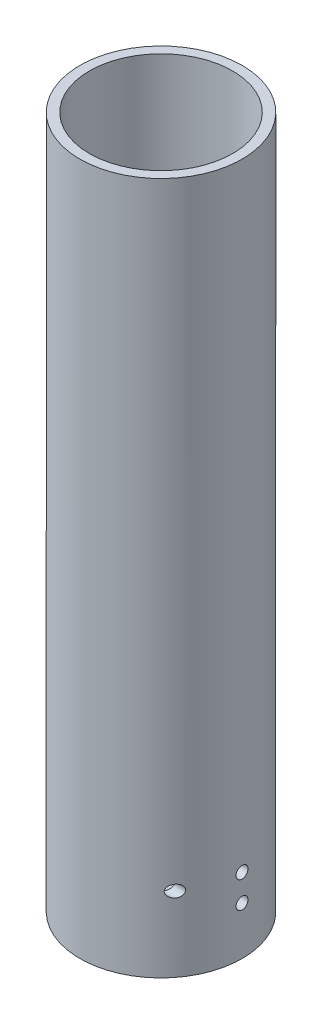
ISO-10303-21;
HEADER;
FILE_DESCRIPTION(('STEP AP214'),'2;1');
FILE_NAME('part.step','',(''),(''),'','','');
FILE_SCHEMA(('AUTOMOTIVE_DESIGN { 1 0 10303 214 1 1 1 1 }'));
ENDSEC;
DATA;
#1=APPLICATION_CONTEXT('core data for automotive mechanical design processes');
#2=APPLICATION_PROTOCOL_DEFINITION('international standard','automotive_design',2000,#1);
#3=PRODUCT_CONTEXT('',#1,'mechanical');
#4=PRODUCT('Part','Part','',(#3));
#5=PRODUCT_RELATED_PRODUCT_CATEGORY('part','',(#4));
#6=PRODUCT_DEFINITION_FORMATION('','',#4);
#7=PRODUCT_DEFINITION_CONTEXT('part definition',#1,'design');
#8=PRODUCT_DEFINITION('design','',#6,#7);
#9=PRODUCT_DEFINITION_SHAPE('','',#8);
#10=(LENGTH_UNIT() NAMED_UNIT(*) SI_UNIT(.MILLI.,.METRE.));
#11=(NAMED_UNIT(*) PLANE_ANGLE_UNIT() SI_UNIT($,.RADIAN.));
#12=(NAMED_UNIT(*) SI_UNIT($,.STERADIAN.) SOLID_ANGLE_UNIT());
#13=UNCERTAINTY_MEASURE_WITH_UNIT(LENGTH_MEASURE(1.E-05),#10,'distance_accuracy_value','');
#14=(GEOMETRIC_REPRESENTATION_CONTEXT(3) GLOBAL_UNCERTAINTY_ASSIGNED_CONTEXT((#13)) GLOBAL_UNIT_ASSIGNED_CONTEXT((#10,
#11,#12)) REPRESENTATION_CONTEXT('',''));
#15=CARTESIAN_POINT('',(0.,0.,0.));
#16=DIRECTION('',(0.,0.,1.));
#17=DIRECTION('',(1.,0.,0.));
#18=AXIS2_PLACEMENT_3D('',#15,#16,#17);
#19=CARTESIAN_POINT('',(0.,140.,0.));
#20=DIRECTION('',(0.,-1.,0.));
#21=DIRECTION('',(0.,0.,-1.));
#22=AXIS2_PLACEMENT_3D('',#19,#20,#21);
#23=CYLINDRICAL_SURFACE('',#22,17.);
#24=CARTESIAN_POINT('',(0.,140.,0.));
#25=DIRECTION('',(0.,1.,0.));
#26=DIRECTION('',(0.,0.,1.));
#27=AXIS2_PLACEMENT_3D('',#24,#25,#26);
#28=CIRCLE('',#27,17.);
#29=CARTESIAN_POINT('',(0.,140.,17.));
#30=VERTEX_POINT('',#29);
#31=EDGE_CURVE('E10',#30,#30,#28,.T.);
#32=ORIENTED_EDGE('',*,*,#31,.F.);
#33=EDGE_LOOP('',(#32));
#34=FACE_BOUND('',#33,.T.);
#35=CARTESIAN_POINT('',(0.,-5.,0.));
#36=DIRECTION('',(0.,-1.,0.));
#37=DIRECTION('',(0.,0.,-1.));
#38=AXIS2_PLACEMENT_3D('',#35,#36,#37);
#39=CIRCLE('',#38,17.);
#40=CARTESIAN_POINT('',(0.,-5.,-17.));
#41=VERTEX_POINT('',#40);
#42=EDGE_CURVE('E97',#41,#41,#39,.T.);
#43=ORIENTED_EDGE('',*,*,#42,.F.);
#44=EDGE_LOOP('',(#43));
#45=FACE_BOUND('',#44,.T.);
#46=CARTESIAN_POINT('',(12.3526034397278,10.6689063433887,11.6796056551934));
#47=CARTESIAN_POINT('',(12.3526050452797,10.6117830538209,11.6796041188875));
#48=CARTESIAN_POINT('',(12.3563381656127,10.5546494273182,11.6756595388602));
#49=CARTESIAN_POINT('',(12.3709163959416,10.4423464650453,11.6602116034412));
#50=CARTESIAN_POINT('',(12.3817664896325,10.3871785343255,11.6487029512601));
#51=CARTESIAN_POINT('',(12.4095658564647,10.2807307183021,11.6190825172819));
#52=CARTESIAN_POINT('',(12.4264744421042,10.2294275951184,11.601014774483));
#53=CARTESIAN_POINT('',(12.465282080562,10.1311976198045,11.55930597497));
#54=CARTESIAN_POINT('',(12.4871836560253,10.0842729968039,11.5356621007767));
#55=CARTESIAN_POINT('',(12.5444865641857,9.977339675201,11.4733725439603));
#56=CARTESIAN_POINT('',(12.5817788909717,9.91963349038183,11.4325136923492));
#57=CARTESIAN_POINT('',(12.6616274113348,9.81384785534665,11.3440189308618));
#58=CARTESIAN_POINT('',(12.7041945573332,9.76578899705376,11.2963688881783));
#59=CARTESIAN_POINT('',(12.8060000682101,9.66622114269812,11.1809608854319));
#60=CARTESIAN_POINT('',(12.8664229938381,9.61796145656463,11.1114454551571));
#61=CARTESIAN_POINT('',(12.9902674969686,9.53698283225218,10.9664067253002));
#62=CARTESIAN_POINT('',(13.0536905646312,9.50427170802753,10.8908804271574));
#63=CARTESIAN_POINT('',(13.1824030075432,9.45391489864469,10.7347385362961));
#64=CARTESIAN_POINT('',(13.2477058949806,9.43646838874405,10.6540699810188));
#65=CARTESIAN_POINT('',(13.3777274715619,9.41766583869734,10.4903453112267));
#66=CARTESIAN_POINT('',(13.4424458406072,9.4163181371467,10.4072879817373));
#67=CARTESIAN_POINT('',(13.5748986164153,9.43100047446755,10.2340096788228));
#68=CARTESIAN_POINT('',(13.6424462631271,9.44846201944534,10.1437588372146));
#69=CARTESIAN_POINT('',(13.7726581137172,9.50425512520184,9.96623997458606));
#70=CARTESIAN_POINT('',(13.8353310333005,9.5425484118271,9.87896679426158));
#71=CARTESIAN_POINT('',(13.9353744807645,9.6260804427821,9.73706790802242));
#72=CARTESIAN_POINT('',(13.9746842417562,9.66576267774237,9.68052004075442));
#73=CARTESIAN_POINT('',(14.0485283647382,9.75583435735589,9.57303950626107));
#74=CARTESIAN_POINT('',(14.0830649918721,9.8062186942088,9.52210417788587));
#75=CARTESIAN_POINT('',(14.1463735225243,9.91773529336315,9.42779823807859));
#76=CARTESIAN_POINT('',(14.1750935773978,9.97895582249573,9.38449607565597));
#77=CARTESIAN_POINT('',(14.2249892794054,10.1105199968638,9.30869235676485));
#78=CARTESIAN_POINT('',(14.2461727904248,10.1808540275688,9.27617954471942));
#79=CARTESIAN_POINT('',(14.2772911060382,10.3173808105524,9.22819901990391));
#80=CARTESIAN_POINT('',(14.2884191794244,10.3826708017922,9.21093202934248));
#81=CARTESIAN_POINT('',(14.3037176772698,10.5159595066296,9.18715781761185));
#82=CARTESIAN_POINT('',(14.3078938542426,10.5839559329644,9.18064170041427));
#83=CARTESIAN_POINT('',(14.3090103901253,10.7124913017673,9.17890059063317));
#84=CARTESIAN_POINT('',(14.3067091663162,10.7730120517699,9.1824921191528));
#85=CARTESIAN_POINT('',(14.2965633163339,10.8924312496822,9.19828053330078));
#86=CARTESIAN_POINT('',(14.2887196312111,10.9513299712314,9.21047595807932));
#87=CARTESIAN_POINT('',(14.2679307093816,11.0652580144872,9.24264631125735));
#88=CARTESIAN_POINT('',(14.2550435935976,11.1203232850391,9.26253257998185));
#89=CARTESIAN_POINT('',(14.2246374018501,11.2260818315445,9.30916013774091));
#90=CARTESIAN_POINT('',(14.2071172838214,11.2767741205111,9.33590296892746));
#91=CARTESIAN_POINT('',(14.16649473502,11.3766006342079,9.39744023632236));
#92=CARTESIAN_POINT('',(14.1430672900247,11.4253173969015,9.43269479603172));
#93=CARTESIAN_POINT('',(14.0921977181718,11.5160254000268,9.50852506749673));
#94=CARTESIAN_POINT('',(14.0647538225743,11.5580136602473,9.54910312276092));
#95=CARTESIAN_POINT('',(14.0024346404783,11.6403869005993,9.64029452594988));
#96=CARTESIAN_POINT('',(13.967057038321,11.6797156229166,9.69151659249575));
#97=CARTESIAN_POINT('',(13.892880471928,11.7492008583913,9.79755424055716));
#98=CARTESIAN_POINT('',(13.8540795126972,11.7793519770587,9.85237191260971));
#99=CARTESIAN_POINT('',(13.7666964120705,11.8352505244753,9.9741982091821));
#100=CARTESIAN_POINT('',(13.7176032006081,11.8592564979711,10.0416388710078));
#101=CARTESIAN_POINT('',(13.6168918768727,11.8953062401406,10.1777918548919));
#102=CARTESIAN_POINT('',(13.5652724616793,11.907343766244,10.2465048215545));
#103=CARTESIAN_POINT('',(13.4512272641178,11.9210799511428,10.3959021973789));
#104=CARTESIAN_POINT('',(13.3885003414573,11.9205825030337,10.4765621138471));
#105=CARTESIAN_POINT('',(13.2623064471626,11.9043736755705,10.635863080248));
#106=CARTESIAN_POINT('',(13.1988386339086,11.8886428985329,10.7145014248963));
#107=CARTESIAN_POINT('',(13.0658141582953,11.8397075592706,10.8764255831265));
#108=CARTESIAN_POINT('',(12.9963530639763,11.8047758984454,10.9592753055889));
#109=CARTESIAN_POINT('',(12.8610457841965,11.7163681426347,11.1177472503364));
#110=CARTESIAN_POINT('',(12.7951945973602,11.6629184962775,11.1933795855259));
#111=CARTESIAN_POINT('',(12.6910379744468,11.5574308651206,11.3111275753113));
#112=CARTESIAN_POINT('',(12.6507371953663,11.5105829728803,11.3561459533478));
#113=CARTESIAN_POINT('',(12.5751068991561,11.4080269210315,11.43983592475));
#114=CARTESIAN_POINT('',(12.5397692842329,11.3523335175936,11.4785178740638));
#115=CARTESIAN_POINT('',(12.4828575649107,11.2448822479486,11.5403490689118));
#116=CARTESIAN_POINT('',(12.4599503431925,11.1947321696676,11.5650550626099));
#117=CARTESIAN_POINT('',(12.4199024917456,11.0895916257044,11.6080526900088));
#118=CARTESIAN_POINT('',(12.4027554148344,11.0346066591865,11.6263514960885));
#119=CARTESIAN_POINT('',(12.3772685541967,10.9282406032907,11.6534770570378));
#120=CARTESIAN_POINT('',(12.3680832159493,10.8772971004468,11.6632155150884));
#121=CARTESIAN_POINT('',(12.3557509905346,10.7738737214084,11.676279384188));
#122=CARTESIAN_POINT('',(12.3526019644574,10.7213943961127,11.6796070668367));
#123=CARTESIAN_POINT('',(12.3526034397278,10.6689063433887,11.6796056551934));
#124=B_SPLINE_CURVE_WITH_KNOTS('',3,(#46,#47,#48,#49,#50,#51,#52,#53,#54,#55,#56,#57,#58,#59,
#60,#61,#62,#63,#64,#65,#66,#67,#68,#69,#70,#71,#72,#73,#74,#75,#76,#77,#78,#79,#80,#81,#82,#83,
#84,#85,#86,#87,#88,#89,#90,#91,#92,#93,#94,#95,#96,#97,#98,#99,#100,#101,#102,#103,#104,#105,
#106,#107,#108,#109,#110,#111,#112,#113,#114,#115,#116,#117,#118,#119,#120,#121,#122,#123),
.UNSPECIFIED.,.T.,.F.,(4,2,2,2,2,2,2,2,2,2,2,2,2,2,2,2,2,2,2,2,2,2,2,2,2,2,2,2,2,2,2,2,2,2,2,2,
2,2,4),(0.,0.171142961782552,0.342405895373957,0.512539583151093,0.682759420084538,
0.921263071554698,1.16027051181133,1.47059348352221,1.78107224407733,2.09554422912971,
2.41017909213956,2.75056877158188,3.09033515502291,3.3278713176067,3.56529436483965,
3.80474870695547,4.04395245639738,4.24811384759981,4.45210621643239,4.63323875953179,
4.81434055565655,4.99341402425062,5.17252780475569,5.36537464827501,5.55830667347788,
5.77837641402882,5.99857526035828,6.25800280886825,6.5175656001868,6.82287539146012,
7.12857446736418,7.46779848491141,7.80653998383667,8.03515733190166,8.26339722838393,
8.44396364849718,8.62432728655689,8.78163870216074,8.93889436564471),.UNSPECIFIED.);
#125=CARTESIAN_POINT('',(12.3526034397278,10.6689063433887,11.6796056551934));
#126=VERTEX_POINT('',#125);
#127=EDGE_CURVE('E61',#126,#126,#124,.T.);
#128=ORIENTED_EDGE('',*,*,#127,.F.);
#129=EDGE_LOOP('',(#128));
#130=FACE_BOUND('',#129,.T.);
#131=CARTESIAN_POINT('',(17.,9.41890634338872,0.));
#132=CARTESIAN_POINT('',(16.9999993933768,9.4189094175482,-0.0701114374009968));
#133=CARTESIAN_POINT('',(16.9995616381418,9.42482491136245,-0.140271293942132));
#134=CARTESIAN_POINT('',(16.9978574325815,9.44833699755417,-0.278651803569587));
#135=CARTESIAN_POINT('',(16.9965900304269,9.46594700703697,-0.346870135286048));
#136=CARTESIAN_POINT('',(16.9933698319174,9.51233787804617,-0.479343249225228));
#137=CARTESIAN_POINT('',(16.9914174101675,9.54111263500522,-0.543600175220227));
#138=CARTESIAN_POINT('',(16.9870464492067,9.60900577583922,-0.66635592104581));
#139=CARTESIAN_POINT('',(16.9846280132903,9.64812186821577,-0.724856012576288));
#140=CARTESIAN_POINT('',(16.9795911820933,9.73567302488676,-0.834571599289302));
#141=CARTESIAN_POINT('',(16.9769724376049,9.78412459824349,-0.885773905619761));
#142=CARTESIAN_POINT('',(16.971833091802,9.88893679559828,-0.979327467680684));
#143=CARTESIAN_POINT('',(16.9693124946942,9.94529775812924,-1.02167834436435));
#144=CARTESIAN_POINT('',(16.9646508997728,10.0644066314624,-1.09636989797495));
#145=CARTESIAN_POINT('',(16.9625103329139,10.1271616678719,-1.12869924106479));
#146=CARTESIAN_POINT('',(16.9588548577996,10.2572275054898,-1.18235757434903));
#147=CARTESIAN_POINT('',(16.9573399406884,10.3245382421986,-1.20368672024734));
#148=CARTESIAN_POINT('',(16.9551100202027,10.4616746122315,-1.23470160843389));
#149=CARTESIAN_POINT('',(16.954393562983,10.5314954349897,-1.2444085150376));
#150=CARTESIAN_POINT('',(16.9538370102126,10.6717787952404,-1.25196874085017));
#151=CARTESIAN_POINT('',(16.9539969015194,10.7422413230935,-1.24982223782256));
#152=CARTESIAN_POINT('',(16.9551736661373,10.8816633041332,-1.23375409879929));
#153=CARTESIAN_POINT('',(16.9561888691461,10.9506254183468,-1.2198554129539));
#154=CARTESIAN_POINT('',(16.9589592357487,11.0852352394591,-1.18071306766581));
#155=CARTESIAN_POINT('',(16.9607144051605,11.1508829202929,-1.15546931902006));
#156=CARTESIAN_POINT('',(16.9647688493341,11.2770738230436,-1.09432754752814));
#157=CARTESIAN_POINT('',(16.9670686524487,11.3376120103653,-1.05841917020422));
#158=CARTESIAN_POINT('',(16.9719527073521,11.4518104230797,-0.976974930058658));
#159=CARTESIAN_POINT('',(16.9745369636057,11.505470540487,-0.931438916113306));
#160=CARTESIAN_POINT('',(16.9797061473361,11.6045230847041,-0.831903010117666));
#161=CARTESIAN_POINT('',(16.9822910618214,11.6498955664564,-0.777883266806281));
#162=CARTESIAN_POINT('',(16.9871644111301,11.7309308565704,-0.662982748302863));
#163=CARTESIAN_POINT('',(16.989452845808,11.7665936601699,-0.602101969745843));
#164=CARTESIAN_POINT('',(16.9934756796063,11.8271957915862,-0.475195034746847));
#165=CARTESIAN_POINT('',(16.995210036429,11.8521343007772,-0.409168485963105));
#166=CARTESIAN_POINT('',(16.997928768922,11.8905662917393,-0.273849933141372));
#167=CARTESIAN_POINT('',(16.9989131567097,11.9040599584291,-0.204557981882798));
#168=CARTESIAN_POINT('',(17.0000194759722,11.9191943705138,-0.0648485325756396));
#169=CARTESIAN_POINT('',(17.0001434129875,11.9208626786702,0.00556596447100608));
#170=CARTESIAN_POINT('',(16.999520211201,11.9123711264656,0.145673719645361));
#171=CARTESIAN_POINT('',(16.9987730787023,11.9022113516928,0.215366982988247));
#172=CARTESIAN_POINT('',(16.9964930937958,11.8703748656696,0.351975823839941));
#173=CARTESIAN_POINT('',(16.9949611085735,11.8487108645001,0.418894379105056));
#174=CARTESIAN_POINT('',(16.9912836430185,11.7944938310118,0.548146305699546));
#175=CARTESIAN_POINT('',(16.9891381550843,11.7619406637703,0.610479620203657));
#176=CARTESIAN_POINT('',(16.9844694753328,11.6867996415993,0.728917485090241));
#177=CARTESIAN_POINT('',(16.9819455964897,11.6441934514357,0.785010375482227));
#178=CARTESIAN_POINT('',(16.9768062475212,11.5501824041896,0.889257583979707));
#179=CARTESIAN_POINT('',(16.9741907761557,11.498777427939,0.937411794548647));
#180=CARTESIAN_POINT('',(16.969157145074,11.388508746897,1.02450867468885));
#181=CARTESIAN_POINT('',(16.9667393753788,11.3296308568985,1.06343341076883));
#182=CARTESIAN_POINT('',(16.9623801004555,11.2061586242311,1.13084360004715));
#183=CARTESIAN_POINT('',(16.9604385913842,11.1415643276979,1.15932913748779));
#184=CARTESIAN_POINT('',(16.9572536347735,11.0085573890849,1.20502152278709));
#185=CARTESIAN_POINT('',(16.9560094982923,10.940148589133,1.22223950480995));
#186=CARTESIAN_POINT('',(16.9543577058632,10.801401527493,1.24494433263389));
#187=CARTESIAN_POINT('',(16.9539500377952,10.7310632937765,1.25043134841208));
#188=CARTESIAN_POINT('',(16.9540174585878,10.5906322592688,1.24951670411437));
#189=CARTESIAN_POINT('',(16.9544904547196,10.5205392721732,1.24314322823113));
#190=CARTESIAN_POINT('',(16.9562614672111,10.3824218264344,1.21874712194012));
#191=CARTESIAN_POINT('',(16.9575594849605,10.3143973712758,1.20072447191039));
#192=CARTESIAN_POINT('',(16.9608337452766,10.182344973161,1.15354838382055));
#193=CARTESIAN_POINT('',(16.9628099680561,10.1183169136713,1.12439527049728));
#194=CARTESIAN_POINT('',(16.9672179652148,9.99605981468618,1.05578922987079));
#195=CARTESIAN_POINT('',(16.9696497300992,9.93783065436504,1.01633651723157));
#196=CARTESIAN_POINT('',(16.9747016202101,9.82868045924323,0.928145776837633));
#197=CARTESIAN_POINT('',(16.9773221570186,9.77777616600717,0.879387052645927));
#198=CARTESIAN_POINT('',(16.9824526257481,9.68485564976804,0.774002405696149));
#199=CARTESIAN_POINT('',(16.984962530604,9.64284159224542,0.71737457173522));
#200=CARTESIAN_POINT('',(16.9895924658213,9.56885086693114,0.597772870871223));
#201=CARTESIAN_POINT('',(16.9917118890984,9.53688977490081,0.534789354121444));
#202=CARTESIAN_POINT('',(16.9953145073056,9.48403637020307,0.404378773565798));
#203=CARTESIAN_POINT('',(16.9967984401831,9.46313121243986,0.33695696919703));
#204=CARTESIAN_POINT('',(16.9985779069779,9.43836268698841,0.224274859262745));
#205=CARTESIAN_POINT('',(16.9991087934339,9.43107612188112,0.179741172690332));
#206=CARTESIAN_POINT('',(16.9998200346295,9.42134696653606,0.0901449965786582));
#207=CARTESIAN_POINT('',(17.0000003900661,9.41890436666674,0.0450825080910232));
#208=CARTESIAN_POINT('',(17.,9.41890634338872,0.));
#209=B_SPLINE_CURVE_WITH_KNOTS('',3,(#131,#132,#133,#134,#135,#136,#137,#138,#139,#140,#141,
#142,#143,#144,#145,#146,#147,#148,#149,#150,#151,#152,#153,#154,#155,#156,#157,#158,#159,#160,
#161,#162,#163,#164,#165,#166,#167,#168,#169,#170,#171,#172,#173,#174,#175,#176,#177,#178,#179,
#180,#181,#182,#183,#184,#185,#186,#187,#188,#189,#190,#191,#192,#193,#194,#195,#196,#197,#198,
#199,#200,#201,#202,#203,#204,#205,#206,#207,#208),.UNSPECIFIED.,.T.,.F.,(4,2,2,2,2,2,2,2,2,2,2,
2,2,2,2,2,2,2,2,2,2,2,2,2,2,2,2,2,2,2,2,2,2,2,2,2,2,2,4),(0.,0.210169723307803,
0.420580991660814,0.630877374853581,0.841127198246115,1.05175230222975,1.2623864240133,
1.47325790024809,1.68412639158951,1.89461030057574,2.1050910529795,2.31516171660797,
2.52523403199222,2.73551098084576,2.94579123063311,3.15657105924423,3.36735099123254,
3.5781470099921,3.7889396227771,3.99924075424873,4.20954036398731,4.4196081127742,
4.62967846450942,4.84013495628746,5.05059429865367,5.26145928663835,5.47232257294588,
5.68297717637261,5.89362872747597,6.10378034450653,6.31393231551899,6.52407815571082,
6.73421961639759,6.94483399244586,7.15549961096416,7.36649003871078,7.57723479030042,
7.71237675062034,7.84751844222939),.UNSPECIFIED.);
#210=CARTESIAN_POINT('',(17.,9.41890634338872,0.));
#211=VERTEX_POINT('',#210);
#212=EDGE_CURVE('E85',#211,#211,#209,.T.);
#213=ORIENTED_EDGE('',*,*,#212,.F.);
#214=EDGE_LOOP('',(#213));
#215=FACE_BOUND('',#214,.T.);
#216=CARTESIAN_POINT('',(17.,3.81890634338872,0.));
#217=CARTESIAN_POINT('',(16.9999993933768,3.8189094175482,-0.0701114374009967));
#218=CARTESIAN_POINT('',(16.9995616381418,3.82482491136245,-0.140271293942132));
#219=CARTESIAN_POINT('',(16.9978574325815,3.84833699755417,-0.278651803569586));
#220=CARTESIAN_POINT('',(16.9965900304269,3.86594700703697,-0.346870135286048));
#221=CARTESIAN_POINT('',(16.9933698319174,3.91233787804617,-0.479343249225228));
#222=CARTESIAN_POINT('',(16.9914174101675,3.94111263500522,-0.543600175220227));
#223=CARTESIAN_POINT('',(16.9870464492067,4.00900577583921,-0.66635592104581));
#224=CARTESIAN_POINT('',(16.9846280132903,4.04812186821577,-0.724856012576288));
#225=CARTESIAN_POINT('',(16.9795911820933,4.13567302488676,-0.834571599289302));
#226=CARTESIAN_POINT('',(16.9769724376049,4.18412459824349,-0.885773905619761));
#227=CARTESIAN_POINT('',(16.971833091802,4.28893679559828,-0.979327467680684));
#228=CARTESIAN_POINT('',(16.9693124946942,4.34529775812924,-1.02167834436435));
#229=CARTESIAN_POINT('',(16.9646508997728,4.46440663146238,-1.09636989797495));
#230=CARTESIAN_POINT('',(16.9625103329139,4.52716166787192,-1.12869924106479));
#231=CARTESIAN_POINT('',(16.9588548577996,4.65722750548984,-1.18235757434903));
#232=CARTESIAN_POINT('',(16.9573399406884,4.72453824219863,-1.20368672024734));
#233=CARTESIAN_POINT('',(16.9551100202027,4.86167461223147,-1.23470160843389));
#234=CARTESIAN_POINT('',(16.954393562983,4.93149543498973,-1.2444085150376));
#235=CARTESIAN_POINT('',(16.9538370102126,5.07177879524043,-1.25196874085017));
#236=CARTESIAN_POINT('',(16.9539969015194,5.1422413230935,-1.24982223782256));
#237=CARTESIAN_POINT('',(16.9551736661373,5.28166330413324,-1.23375409879929));
#238=CARTESIAN_POINT('',(16.9561888691461,5.35062541834676,-1.2198554129539));
#239=CARTESIAN_POINT('',(16.9589592357487,5.4852352394591,-1.18071306766581));
#240=CARTESIAN_POINT('',(16.9607144051605,5.55088292029295,-1.15546931902006));
#241=CARTESIAN_POINT('',(16.9647688493341,5.67707382304359,-1.09432754752814));
#242=CARTESIAN_POINT('',(16.9670686524487,5.73761201036529,-1.05841917020423));
#243=CARTESIAN_POINT('',(16.9719527073521,5.8518104230797,-0.976974930058659));
#244=CARTESIAN_POINT('',(16.9745369636057,5.90547054048703,-0.931438916113307));
#245=CARTESIAN_POINT('',(16.9797061473361,6.00452308470413,-0.831903010117667));
#246=CARTESIAN_POINT('',(16.9822910618214,6.04989556645643,-0.777883266806282));
#247=CARTESIAN_POINT('',(16.9871644111301,6.13093085657037,-0.662982748302864));
#248=CARTESIAN_POINT('',(16.989452845808,6.16659366016989,-0.602101969745844));
#249=CARTESIAN_POINT('',(16.9934756796063,6.22719579158618,-0.475195034746848));
#250=CARTESIAN_POINT('',(16.995210036429,6.25213430077717,-0.409168485963106));
#251=CARTESIAN_POINT('',(16.997928768922,6.29056629173932,-0.273849933141372));
#252=CARTESIAN_POINT('',(16.9989131567097,6.30405995842905,-0.204557981882798));
#253=CARTESIAN_POINT('',(17.0000194759722,6.31919437051377,-0.0648485325756397));
#254=CARTESIAN_POINT('',(17.0001434129875,6.32086267867023,0.00556596447100576));
#255=CARTESIAN_POINT('',(16.999520211201,6.31237112646562,0.14567371964536));
#256=CARTESIAN_POINT('',(16.9987730787023,6.30221135169275,0.215366982988247));
#257=CARTESIAN_POINT('',(16.9964930937958,6.27037486566961,0.351975823839941));
#258=CARTESIAN_POINT('',(16.9949611085735,6.24871086450011,0.418894379105055));
#259=CARTESIAN_POINT('',(16.9912836430185,6.19449383101176,0.548146305699545));
#260=CARTESIAN_POINT('',(16.9891381550843,6.16194066377031,0.610479620203656));
#261=CARTESIAN_POINT('',(16.9844694753328,6.08679964159935,0.728917485090241));
#262=CARTESIAN_POINT('',(16.9819455964897,6.04419345143569,0.785010375482226));
#263=CARTESIAN_POINT('',(16.9768062475212,5.95018240418964,0.889257583979706));
#264=CARTESIAN_POINT('',(16.9741907761557,5.89877742793899,0.937411794548647));
#265=CARTESIAN_POINT('',(16.969157145074,5.78850874689705,1.02450867468885));
#266=CARTESIAN_POINT('',(16.9667393753788,5.72963085689848,1.06343341076883));
#267=CARTESIAN_POINT('',(16.9623801004555,5.60615862423114,1.13084360004715));
#268=CARTESIAN_POINT('',(16.9604385913842,5.54156432769788,1.15932913748779));
#269=CARTESIAN_POINT('',(16.9572536347735,5.40855738908493,1.20502152278709));
#270=CARTESIAN_POINT('',(16.9560094982923,5.340148589133,1.22223950480995));
#271=CARTESIAN_POINT('',(16.9543577058632,5.20140152749296,1.24494433263389));
#272=CARTESIAN_POINT('',(16.9539500377952,5.13106329377655,1.25043134841208));
#273=CARTESIAN_POINT('',(16.9540174585878,4.99063225926883,1.24951670411437));
#274=CARTESIAN_POINT('',(16.9544904547196,4.92053927217318,1.24314322823114));
#275=CARTESIAN_POINT('',(16.9562614672111,4.78242182643443,1.21874712194012));
#276=CARTESIAN_POINT('',(16.9575594849605,4.71439737127578,1.20072447191039));
#277=CARTESIAN_POINT('',(16.9608337452766,4.58234497316096,1.15354838382055));
#278=CARTESIAN_POINT('',(16.9628099680561,4.51831691367135,1.12439527049728));
#279=CARTESIAN_POINT('',(16.9672179652148,4.39605981468618,1.05578922987079));
#280=CARTESIAN_POINT('',(16.9696497300992,4.33783065436504,1.01633651723157));
#281=CARTESIAN_POINT('',(16.9747016202101,4.22868045924324,0.928145776837634));
#282=CARTESIAN_POINT('',(16.9773221570186,4.17777616600717,0.879387052645927));
#283=CARTESIAN_POINT('',(16.9824526257481,4.08485564976804,0.77400240569615));
#284=CARTESIAN_POINT('',(16.984962530604,4.04284159224542,0.717374571735221));
#285=CARTESIAN_POINT('',(16.9895924658213,3.96885086693114,0.597772870871224));
#286=CARTESIAN_POINT('',(16.9917118890984,3.93688977490081,0.534789354121445));
#287=CARTESIAN_POINT('',(16.9953145073056,3.88403637020307,0.404378773565798));
#288=CARTESIAN_POINT('',(16.9967984401831,3.86313121243986,0.33695696919703));
#289=CARTESIAN_POINT('',(16.9985779069779,3.83836268698841,0.224274859262745));
#290=CARTESIAN_POINT('',(16.9991087934339,3.83107612188112,0.179741172690332));
#291=CARTESIAN_POINT('',(16.9998200346295,3.82134696653605,0.0901449965786581));
#292=CARTESIAN_POINT('',(17.0000003900661,3.81890436666673,0.0450825080910231));
#293=CARTESIAN_POINT('',(17.,3.81890634338872,0.));
#294=B_SPLINE_CURVE_WITH_KNOTS('',3,(#216,#217,#218,#219,#220,#221,#222,#223,#224,#225,#226,
#227,#228,#229,#230,#231,#232,#233,#234,#235,#236,#237,#238,#239,#240,#241,#242,#243,#244,#245,
#246,#247,#248,#249,#250,#251,#252,#253,#254,#255,#256,#257,#258,#259,#260,#261,#262,#263,#264,
#265,#266,#267,#268,#269,#270,#271,#272,#273,#274,#275,#276,#277,#278,#279,#280,#281,#282,#283,
#284,#285,#286,#287,#288,#289,#290,#291,#292,#293),.UNSPECIFIED.,.T.,.F.,(4,2,2,2,2,2,2,2,2,2,2,
2,2,2,2,2,2,2,2,2,2,2,2,2,2,2,2,2,2,2,2,2,2,2,2,2,2,2,4),(0.,0.210169723307803,
0.420580991660815,0.630877374853582,0.841127198246115,1.05175230222975,1.2623864240133,
1.47325790024809,1.68412639158951,1.89461030057574,2.1050910529795,2.31516171660797,
2.52523403199222,2.73551098084576,2.94579123063311,3.15657105924423,3.36735099123254,
3.5781470099921,3.7889396227771,3.99924075424873,4.20954036398731,4.4196081127742,
4.62967846450942,4.84013495628746,5.05059429865367,5.26145928663836,5.47232257294588,
5.68297717637261,5.89362872747597,6.10378034450653,6.31393231551899,6.52407815571083,
6.7342196163976,6.94483399244586,7.15549961096416,7.36649003871078,7.57723479030042,
7.71237675062035,7.84751844222939),.UNSPECIFIED.);
#295=CARTESIAN_POINT('',(17.,3.81890634338872,0.));
#296=VERTEX_POINT('',#295);
#297=EDGE_CURVE('E91',#296,#296,#294,.T.);
#298=ORIENTED_EDGE('',*,*,#297,.F.);
#299=EDGE_LOOP('',(#298));
#300=FACE_BOUND('',#299,.T.);
#301=ADVANCED_FACE('F33',(#34,#45,#130,#215,#300),#23,.T.);
#302=CARTESIAN_POINT('',(0.,140.,0.));
#303=DIRECTION('',(0.,-1.,0.));
#304=DIRECTION('',(0.,0.,-1.));
#305=AXIS2_PLACEMENT_3D('',#302,#303,#304);
#306=CYLINDRICAL_SURFACE('',#305,15.);
#307=CARTESIAN_POINT('',(14.9478259288767,10.6689063433887,1.25));
#308=CARTESIAN_POINT('',(14.9478266201045,10.5988242074007,1.24999693853797));
#309=CARTESIAN_POINT('',(14.9483240997827,10.5286943606916,1.24408636494978));
#310=CARTESIAN_POINT('',(14.9502602468658,10.3903750679594,1.22059497384286));
#311=CARTESIAN_POINT('',(14.9516999806891,10.3221879119792,1.20300093295207));
#312=CARTESIAN_POINT('',(14.9553564437001,10.1897773482321,1.15665498092191));
#313=CARTESIAN_POINT('',(14.95757273232,10.125551717195,1.12790939546941));
#314=CARTESIAN_POINT('',(14.9625320337702,10.0028523493763,1.06008758560682));
#315=CARTESIAN_POINT('',(14.9652749339588,9.94437738656992,1.02101356976587));
#316=CARTESIAN_POINT('',(14.9709863097435,9.83467383955541,0.933535670572544));
#317=CARTESIAN_POINT('',(14.9739552846128,9.78346205356001,0.885110751752348));
#318=CARTESIAN_POINT('',(14.9797797076347,9.68988288559119,0.780350150845118));
#319=CARTESIAN_POINT('',(14.9826351508228,9.64751589002924,0.724014123317098));
#320=CARTESIAN_POINT('',(14.987915506344,9.57277307506849,0.604930306635988));
#321=CARTESIAN_POINT('',(14.9903397902493,9.54041178941191,0.542173365157325));
#322=CARTESIAN_POINT('',(14.9944792971536,9.4866919794906,0.412093000623455));
#323=CARTESIAN_POINT('',(14.9961945325633,9.46533326264096,0.344769657520203));
#324=CARTESIAN_POINT('',(14.9987191931584,9.43427323856867,0.207634744934765));
#325=CARTESIAN_POINT('',(14.9995307297494,9.42454475448941,0.137829370290403));
#326=CARTESIAN_POINT('',(15.0001637091778,9.41693733940798,-0.00242785236227304));
#327=CARTESIAN_POINT('',(14.999985170427,9.41905818805134,-0.0728796883244346));
#328=CARTESIAN_POINT('',(14.9986598579849,9.43506700861293,-0.212245689398517));
#329=CARTESIAN_POINT('',(14.9975154890316,9.44892575564397,-0.281163237590581));
#330=CARTESIAN_POINT('',(14.9943899981827,9.48797153209133,-0.415690582550306));
#331=CARTESIAN_POINT('',(14.9924088683258,9.5131586692919,-0.481300347839377));
#332=CARTESIAN_POINT('',(14.9878285989037,9.57417882728693,-0.607442700796069));
#333=CARTESIAN_POINT('',(14.985228700317,9.61002493663717,-0.667968928323716));
#334=CARTESIAN_POINT('',(14.9797030658656,9.69133599536199,-0.782156669846711));
#335=CARTESIAN_POINT('',(14.9767773233922,9.73680113984574,-0.835818044562337));
#336=CARTESIAN_POINT('',(14.9709183093409,9.83622439333278,-0.93492370597737));
#337=CARTESIAN_POINT('',(14.9679850419083,9.89020789691222,-0.980342520831284));
#338=CARTESIAN_POINT('',(14.9624505221547,10.0050469747841,-1.06147699865338));
#339=CARTESIAN_POINT('',(14.9598492701074,10.0659025547414,-1.09719265362289));
#340=CARTESIAN_POINT('',(14.9552728262123,10.1927762031035,-1.15790600574156));
#341=CARTESIAN_POINT('',(14.9532977115918,10.2587949070723,-1.18290238091838));
#342=CARTESIAN_POINT('',(14.9501986659998,10.3941122409525,-1.22144875878564));
#343=CARTESIAN_POINT('',(14.9490747171335,10.463410801876,-1.2349990021185));
#344=CARTESIAN_POINT('',(14.9478081612067,10.6030978265828,-1.25023622864077));
#345=CARTESIAN_POINT('',(14.947662615853,10.6734823901973,-1.25195873264736));
#346=CARTESIAN_POINT('',(14.9483615901727,10.8135392729508,-1.24358463130603));
#347=CARTESIAN_POINT('',(14.9492061006115,10.8832115987269,-1.23348813619853));
#348=CARTESIAN_POINT('',(14.9517873518093,11.0197642881382,-1.2017922515531));
#349=CARTESIAN_POINT('',(14.9535228066559,11.0866485258426,-1.18020943873681));
#350=CARTESIAN_POINT('',(14.9576893372452,11.2158464460934,-1.1261704277873));
#351=CARTESIAN_POINT('',(14.9601204241495,11.2781600552828,-1.09371405518383));
#352=CARTESIAN_POINT('',(14.9654114182898,11.3966104086628,-1.01875935997369));
#353=CARTESIAN_POINT('',(14.9682723304176,11.4527321288867,-0.976237367106297));
#354=CARTESIAN_POINT('',(14.9740972221722,11.5570537695223,-0.882392660519386));
#355=CARTESIAN_POINT('',(14.9770612035719,11.6052535535916,-0.831069795361585));
#356=CARTESIAN_POINT('',(14.9827670138603,11.6924843506013,-0.720926716139681));
#357=CARTESIAN_POINT('',(14.9855082724759,11.7314922846426,-0.662088190512289));
#358=CARTESIAN_POINT('',(14.9904515483882,11.7990737353444,-0.538675241518006));
#359=CARTESIAN_POINT('',(14.9926535710734,11.8276473562746,-0.474100875477221));
#360=CARTESIAN_POINT('',(14.9962676402419,11.8735094464088,-0.341131973458798));
#361=CARTESIAN_POINT('',(14.9976806854396,11.890812187321,-0.272742388150758));
#362=CARTESIAN_POINT('',(14.9995616416229,11.9136880005813,-0.134016473832874));
#363=CARTESIAN_POINT('',(15.0000295704984,11.9192612949532,-0.0636801816972865));
#364=CARTESIAN_POINT('',(14.9999675984173,11.9185174188875,0.0767150604948764));
#365=CARTESIAN_POINT('',(14.9994407158086,11.9122362160905,0.146774205264231));
#366=CARTESIAN_POINT('',(14.9974542924443,11.8880366502493,0.284838890076665));
#367=CARTESIAN_POINT('',(14.9959947504219,11.8701182713991,0.352844427330349));
#368=CARTESIAN_POINT('',(14.9923067712992,11.8231621307358,0.484873808060938));
#369=CARTESIAN_POINT('',(14.9900783788777,11.794125015035,0.548897882650324));
#370=CARTESIAN_POINT('',(14.9851019995099,11.7257597866416,0.671168216123777));
#371=CARTESIAN_POINT('',(14.9823540207807,11.6864318366897,0.729414566357571));
#372=CARTESIAN_POINT('',(14.9766369812704,11.5984663248274,0.838660111781823));
#373=CARTESIAN_POINT('',(14.9736673036685,11.5498021492055,0.889637844980768));
#374=CARTESIAN_POINT('',(14.9678468122527,11.4445936324813,0.982722283199429));
#375=CARTESIAN_POINT('',(14.9649960273997,11.3880473857851,1.02482683681029));
#376=CARTESIAN_POINT('',(14.9597303051085,11.2685700925125,1.09902672372357));
#377=CARTESIAN_POINT('',(14.9573161943526,11.2056272808872,1.13110315432308));
#378=CARTESIAN_POINT('',(14.9532072450657,11.0752720474705,1.18419112616724));
#379=CARTESIAN_POINT('',(14.9515115800288,11.0078648653672,1.20521538866183));
#380=CARTESIAN_POINT('',(14.9494676023508,10.8948677381047,1.23024762250761));
#381=CARTESIAN_POINT('',(14.9488548048632,10.8500045274155,1.23764491757305));
#382=CARTESIAN_POINT('',(14.9480337446537,10.7597363394202,1.24752209188332));
#383=CARTESIAN_POINT('',(14.9478254808448,10.7143313635702,1.25000198434269));
#384=CARTESIAN_POINT('',(14.9478259288767,10.6689063433887,1.25));
#385=B_SPLINE_CURVE_WITH_KNOTS('',3,(#307,#308,#309,#310,#311,#312,#313,#314,#315,#316,#317,
#318,#319,#320,#321,#322,#323,#324,#325,#326,#327,#328,#329,#330,#331,#332,#333,#334,#335,#336,
#337,#338,#339,#340,#341,#342,#343,#344,#345,#346,#347,#348,#349,#350,#351,#352,#353,#354,#355,
#356,#357,#358,#359,#360,#361,#362,#363,#364,#365,#366,#367,#368,#369,#370,#371,#372,#373,#374,
#375,#376,#377,#378,#379,#380,#381,#382,#383,#384),.UNSPECIFIED.,.T.,.F.,(4,2,2,2,2,2,2,2,2,2,2,
2,2,2,2,2,2,2,2,2,2,2,2,2,2,2,2,2,2,2,2,2,2,2,2,2,2,2,4),(0.,0.210080552563243,
0.420399280896465,0.630598880471489,0.84075356854478,1.05138663986468,1.26202891140376,
1.4729757282559,1.68391885264722,1.89436808777528,2.1048134093263,2.31473630155854,
2.52466119114969,2.73484492751256,2.94503292757809,3.15585980028507,3.36668684678383,
3.57753988639351,3.78838849293804,3.99860360537384,4.20881675706685,4.41872735462258,
4.62864132043181,4.83905391053756,5.04947012161604,5.2604091467123,5.47134606384328,
5.68201536101254,5.89268067043992,6.10270782921743,6.31273527325999,6.52275051441036,
6.73276243454839,6.94338215404617,7.15405288221726,7.36511835673396,7.5759403560923,
7.712108280345,7.84827583867342),.UNSPECIFIED.);
#386=CARTESIAN_POINT('',(14.9478259288767,10.6689063433887,1.25));
#387=VERTEX_POINT('',#386);
#388=EDGE_CURVE('E62',#387,#387,#385,.T.);
#389=ORIENTED_EDGE('',*,*,#388,.T.);
#390=EDGE_LOOP('',(#389));
#391=FACE_BOUND('',#390,.T.);
#392=CARTESIAN_POINT('',(0.,0.,0.));
#393=DIRECTION('',(0.,1.,0.));
#394=DIRECTION('',(0.,0.,1.));
#395=AXIS2_PLACEMENT_3D('',#392,#393,#394);
#396=CIRCLE('',#395,15.);
#397=CARTESIAN_POINT('',(0.,0.,15.));
#398=VERTEX_POINT('',#397);
#399=EDGE_CURVE('E51',#398,#398,#396,.T.);
#400=ORIENTED_EDGE('',*,*,#399,.F.);
#401=EDGE_LOOP('',(#400));
#402=FACE_BOUND('',#401,.T.);
#403=CARTESIAN_POINT('',(0.,140.,0.));
#404=DIRECTION('',(0.,1.,0.));
#405=DIRECTION('',(0.,0.,1.));
#406=AXIS2_PLACEMENT_3D('',#403,#404,#405);
#407=CIRCLE('',#406,15.);
#408=CARTESIAN_POINT('',(0.,140.,15.));
#409=VERTEX_POINT('',#408);
#410=EDGE_CURVE('E46',#409,#409,#407,.T.);
#411=ORIENTED_EDGE('',*,*,#410,.T.);
#412=EDGE_LOOP('',(#411));
#413=FACE_BOUND('',#412,.T.);
#414=CARTESIAN_POINT('',(9.41205672205463,10.6689063433887,11.6796056551934));
#415=CARTESIAN_POINT('',(9.41206294368782,10.6161796458621,11.6796010377117));
#416=CARTESIAN_POINT('',(9.41625378697197,10.5633495357498,11.676227225599));
#417=CARTESIAN_POINT('',(9.43252364437124,10.4596782039716,11.6630870164831));
#418=CARTESIAN_POINT('',(9.4446274216436,10.4088437588148,11.65330055116));
#419=CARTESIAN_POINT('',(9.47528149306051,10.3112297889809,11.628388537986));
#420=CARTESIAN_POINT('',(9.49376235753263,10.2644131109767,11.613320466075));
#421=CARTESIAN_POINT('',(9.53577313429963,10.1749003990542,11.5788501738058));
#422=CARTESIAN_POINT('',(9.55930345372485,10.132204697807,11.5594476039581));
#423=CARTESIAN_POINT('',(9.62423315997719,10.0286083980245,11.5055093037986));
#424=CARTESIAN_POINT('',(9.66832523807896,9.97067271149796,11.4685330799826));
#425=CARTESIAN_POINT('',(9.762330150304,9.86440492292532,11.388624035274));
#426=CARTESIAN_POINT('',(9.81225933770836,9.81610087981813,11.3456744122783));
#427=CARTESIAN_POINT('',(9.94010945385029,9.70769838891418,11.2340716418582));
#428=CARTESIAN_POINT('',(10.0201426720267,9.6527525897798,11.162836619398));
#429=CARTESIAN_POINT('',(10.1838405349105,9.56029257583101,11.0137064546862));
#430=CARTESIAN_POINT('',(10.2675086756379,9.52279556785091,10.935804827496));
#431=CARTESIAN_POINT('',(10.4385223254874,9.46370614921892,10.7727255629281));
#432=CARTESIAN_POINT('',(10.5259028548152,9.4426246172966,10.6873997576405));
#433=CARTESIAN_POINT('',(10.6997455847873,9.41862784211338,10.5133513689014));
#434=CARTESIAN_POINT('',(10.7862081584443,9.41570491410258,10.4246302383537));
#435=CARTESIAN_POINT('',(10.9490048256787,9.42867073286024,10.2533924673165));
#436=CARTESIAN_POINT('',(11.0255766250328,9.4429875616748,10.1709865775771));
#437=CARTESIAN_POINT('',(11.1744214759134,9.48936576378482,10.0072215799229));
#438=CARTESIAN_POINT('',(11.2466992106875,9.52140739724093,9.92586141036113));
#439=CARTESIAN_POINT('',(11.3679142941551,9.59483921186033,9.78656794526854));
#440=CARTESIAN_POINT('',(11.4182796743961,9.63211745736162,9.72771293245666));
#441=CARTESIAN_POINT('',(11.5137209193244,9.71851521689309,9.61455551897939));
#442=CARTESIAN_POINT('',(11.5588041505122,9.76761794109186,9.56024680896944));
#443=CARTESIAN_POINT('',(11.6337590517691,9.86703129770134,9.46881433989047));
#444=CARTESIAN_POINT('',(11.664879823077,9.91521514235591,9.43040939912358));
#445=CARTESIAN_POINT('',(11.7214773548665,10.019056337704,9.35996840302311));
#446=CARTESIAN_POINT('',(11.7469556681353,10.0747116254905,9.32793059572356));
#447=CARTESIAN_POINT('',(11.7912672234848,10.1930541312208,9.2718560523799));
#448=CARTESIAN_POINT('',(11.8100431225233,10.2557962546394,9.24788845596441));
#449=CARTESIAN_POINT('',(11.8395033441055,10.38607189121,9.21014372231438));
#450=CARTESIAN_POINT('',(11.850195860994,10.4536004760122,9.19635626552646));
#451=CARTESIAN_POINT('',(11.8618735525619,10.5810408090718,9.18128688402171));
#452=CARTESIAN_POINT('',(11.8640209882632,10.6406735022642,9.17850792789054));
#453=CARTESIAN_POINT('',(11.8617185671562,10.7595861355542,9.18148342785217));
#454=CARTESIAN_POINT('',(11.8572710761785,10.8188661944955,9.18723482380986));
#455=CARTESIAN_POINT('',(11.8425005909695,10.9315939148879,9.20626468906668));
#456=CARTESIAN_POINT('',(11.8325569798662,10.9851757779501,9.21905692831083));
#457=CARTESIAN_POINT('',(11.8075299598781,11.0890922401798,9.25108896955183));
#458=CARTESIAN_POINT('',(11.792446087007,11.1394265457183,9.27032935358858));
#459=CARTESIAN_POINT('',(11.7566239887279,11.2389410491983,9.31572189483084));
#460=CARTESIAN_POINT('',(11.7355899019542,11.2878497485156,9.34223253694642));
#461=CARTESIAN_POINT('',(11.6891259205729,11.3802596555221,9.40030434145999));
#462=CARTESIAN_POINT('',(11.6636934494547,11.4237576678865,9.43186846330492));
#463=CARTESIAN_POINT('',(11.5977387456995,11.5220274372845,9.51294831166683));
#464=CARTESIAN_POINT('',(11.5553515972348,11.5739157782303,9.56445424636524));
#465=CARTESIAN_POINT('',(11.464965625075,11.6661768177021,9.67261920810835));
#466=CARTESIAN_POINT('',(11.4169557725411,11.7065263311615,9.72928831262145));
#467=CARTESIAN_POINT('',(11.3016609819752,11.7866955999241,9.86318388557579));
#468=CARTESIAN_POINT('',(11.2329303354427,11.8226838520244,9.94145490284928));
#469=CARTESIAN_POINT('',(11.0908884365674,11.8774903916365,10.0996806812077));
#470=CARTESIAN_POINT('',(11.0175743394164,11.8962979002428,10.1796364671547));
#471=CARTESIAN_POINT('',(10.8666995413846,11.9184227031513,10.340562381697));
#472=CARTESIAN_POINT('',(10.7890841146611,11.9214331679668,10.4215221939221));
#473=CARTESIAN_POINT('',(10.6324720216613,11.9122534979689,10.5812617354931));
#474=CARTESIAN_POINT('',(10.5534740599889,11.9000482615587,10.6600392195038));
#475=CARTESIAN_POINT('',(10.3789633150105,11.8568533105339,10.8302741282795));
#476=CARTESIAN_POINT('',(10.2834607192037,11.8224616309792,10.9209270029822));
#477=CARTESIAN_POINT('',(10.142911699244,11.7545885772483,11.0510390686945));
#478=CARTESIAN_POINT('',(10.096515322927,11.729251816956,11.0934297063281));
#479=CARTESIAN_POINT('',(10.0051493845773,11.6729165036619,11.1759006834429));
#480=CARTESIAN_POINT('',(9.9601788887585,11.6419217497915,11.2159825495618));
#481=CARTESIAN_POINT('',(9.86490626553484,11.5681716993132,11.2999250759405));
#482=CARTESIAN_POINT('',(9.81499455530858,11.5243132119931,11.3432725871056));
#483=CARTESIAN_POINT('',(9.71982681726908,11.4277414234259,11.4249235208122));
#484=CARTESIAN_POINT('',(9.67456323888221,11.3750428612092,11.463235153087));
#485=CARTESIAN_POINT('',(9.60159128253388,11.2743382836448,11.5243710589462));
#486=CARTESIAN_POINT('',(9.57230871522434,11.2283903352464,11.5486830268674));
#487=CARTESIAN_POINT('',(9.51949418638582,11.1310477068278,11.5922560634127));
#488=CARTESIAN_POINT('',(9.49595565538016,11.0796593464364,11.6115229040296));
#489=CARTESIAN_POINT('',(9.46068434596676,10.9831990645953,11.6402689614574));
#490=CARTESIAN_POINT('',(9.44751761019193,10.9390127238225,11.6509475702508));
#491=CARTESIAN_POINT('',(9.42708191122884,10.8484779217623,11.6674891886544));
#492=CARTESIAN_POINT('',(9.41979642746374,10.802135906378,11.6733656880792));
#493=CARTESIAN_POINT('',(9.41453674894492,10.7410341432327,11.6776067299544));
#494=CARTESIAN_POINT('',(9.41360853311705,10.726637600233,11.6783549915695));
#495=CARTESIAN_POINT('',(9.41236760575213,10.6977987473191,11.6793551364151));
#496=CARTESIAN_POINT('',(9.41205501697665,10.683356428852,11.6796069206435));
#497=CARTESIAN_POINT('',(9.41205672205463,10.6689063433887,11.6796056551934));
#498=B_SPLINE_CURVE_WITH_KNOTS('',3,(#414,#415,#416,#417,#418,#419,#420,#421,#422,#423,#424,
#425,#426,#427,#428,#429,#430,#431,#432,#433,#434,#435,#436,#437,#438,#439,#440,#441,#442,#443,
#444,#445,#446,#447,#448,#449,#450,#451,#452,#453,#454,#455,#456,#457,#458,#459,#460,#461,#462,
#463,#464,#465,#466,#467,#468,#469,#470,#471,#472,#473,#474,#475,#476,#477,#478,#479,#480,#481,
#482,#483,#484,#485,#486,#487,#488,#489,#490,#491,#492,#493,#494,#495,#496,#497),.UNSPECIFIED.,
.T.,.F.,(4,2,2,2,2,2,2,2,2,2,2,2,2,2,2,2,2,2,2,2,2,2,2,2,2,2,2,2,2,2,2,2,2,2,2,2,2,2,2,2,2,4),
(0.,0.158105389901877,0.316707947081708,0.473635549597871,0.630575809719666,0.874171305325442,
1.11846639661441,1.47776644834993,1.83742007087368,2.20786317335311,2.57814949304014,
2.91708189211644,3.25563758516875,3.51262968689818,3.76925900963649,3.97554249363077,
4.18176913830484,4.38972011706987,4.59746000653612,4.77571881889789,4.95391369906491,
5.12111580056155,5.28833299857366,5.46606284341674,5.64389715470358,5.89603568402807,
6.14867733388847,6.4775302629861,6.80658936738829,7.14201681819695,7.47777744624477,
7.88393661217874,8.08699379447243,8.28991512964885,8.52727488520441,8.764242754976,
8.94265692003712,9.1208660655771,9.26229164494249,9.40331856044216,9.44663970633736,
9.48996948998497),.UNSPECIFIED.);
#499=CARTESIAN_POINT('',(9.41205672205463,10.6689063433887,11.6796056551934));
#500=VERTEX_POINT('',#499);
#501=EDGE_CURVE('E55',#500,#500,#498,.T.);
#502=ORIENTED_EDGE('',*,*,#501,.T.);
#503=EDGE_LOOP('',(#502));
#504=FACE_BOUND('',#503,.T.);
#505=CARTESIAN_POINT('',(14.9478259288767,5.06890634338872,1.25));
#506=CARTESIAN_POINT('',(14.9478266201045,4.99882420740071,1.24999693853798));
#507=CARTESIAN_POINT('',(14.9483240997827,4.92869436069162,1.24408636494978));
#508=CARTESIAN_POINT('',(14.9502602468658,4.79037506795943,1.22059497384286));
#509=CARTESIAN_POINT('',(14.9516999806891,4.7221879119792,1.20300093295207));
#510=CARTESIAN_POINT('',(14.9553564437001,4.58977734823205,1.15665498092191));
#511=CARTESIAN_POINT('',(14.95757273232,4.52555171719502,1.12790939546941));
#512=CARTESIAN_POINT('',(14.9625320337702,4.40285234937633,1.06008758560682));
#513=CARTESIAN_POINT('',(14.9652749339588,4.34437738656992,1.02101356976587));
#514=CARTESIAN_POINT('',(14.9709863097435,4.23467383955541,0.933535670572544));
#515=CARTESIAN_POINT('',(14.9739552846128,4.18346205356001,0.885110751752347));
#516=CARTESIAN_POINT('',(14.9797797076347,4.08988288559119,0.780350150845117));
#517=CARTESIAN_POINT('',(14.9826351508228,4.04751589002924,0.724014123317097));
#518=CARTESIAN_POINT('',(14.987915506344,3.97277307506849,0.604930306635987));
#519=CARTESIAN_POINT('',(14.9903397902493,3.9404117894119,0.542173365157324));
#520=CARTESIAN_POINT('',(14.9944792971536,3.8866919794906,0.412093000623453));
#521=CARTESIAN_POINT('',(14.9961945325633,3.86533326264096,0.344769657520202));
#522=CARTESIAN_POINT('',(14.9987191931584,3.83427323856867,0.207634744934763));
#523=CARTESIAN_POINT('',(14.9995307297494,3.82454475448941,0.137829370290402));
#524=CARTESIAN_POINT('',(15.0001637091778,3.81693733940798,-0.00242785236227428));
#525=CARTESIAN_POINT('',(14.999985170427,3.81905818805134,-0.0728796883244358));
#526=CARTESIAN_POINT('',(14.9986598579849,3.83506700861293,-0.212245689398519));
#527=CARTESIAN_POINT('',(14.9975154890316,3.84892575564397,-0.281163237590582));
#528=CARTESIAN_POINT('',(14.9943899981827,3.88797153209133,-0.415690582550307));
#529=CARTESIAN_POINT('',(14.9924088683258,3.9131586692919,-0.481300347839378));
#530=CARTESIAN_POINT('',(14.9878285989037,3.97417882728693,-0.607442700796071));
#531=CARTESIAN_POINT('',(14.985228700317,4.01002493663717,-0.667968928323718));
#532=CARTESIAN_POINT('',(14.9797030658656,4.09133599536199,-0.782156669846712));
#533=CARTESIAN_POINT('',(14.9767773233922,4.13680113984574,-0.835818044562338));
#534=CARTESIAN_POINT('',(14.9709183093409,4.23622439333278,-0.934923705977371));
#535=CARTESIAN_POINT('',(14.9679850419083,4.29020789691222,-0.980342520831284));
#536=CARTESIAN_POINT('',(14.9624505221547,4.40504697478413,-1.06147699865338));
#537=CARTESIAN_POINT('',(14.9598492701074,4.46590255474143,-1.0971926536229));
#538=CARTESIAN_POINT('',(14.9552728262123,4.59277620310347,-1.15790600574156));
#539=CARTESIAN_POINT('',(14.9532977115918,4.65879490707233,-1.18290238091838));
#540=CARTESIAN_POINT('',(14.9501986659998,4.79411224095246,-1.22144875878564));
#541=CARTESIAN_POINT('',(14.9490747171335,4.86341080187597,-1.2349990021185));
#542=CARTESIAN_POINT('',(14.9478081612067,5.00309782658283,-1.25023622864077));
#543=CARTESIAN_POINT('',(14.947662615853,5.07348239019733,-1.25195873264736));
#544=CARTESIAN_POINT('',(14.9483615901727,5.21353927295076,-1.24358463130603));
#545=CARTESIAN_POINT('',(14.9492061006115,5.2832115987269,-1.23348813619853));
#546=CARTESIAN_POINT('',(14.9517873518093,5.41976428813815,-1.2017922515531));
#547=CARTESIAN_POINT('',(14.9535228066559,5.48664852584259,-1.18020943873681));
#548=CARTESIAN_POINT('',(14.9576893372452,5.61584644609339,-1.1261704277873));
#549=CARTESIAN_POINT('',(14.9601204241495,5.67816005528281,-1.09371405518383));
#550=CARTESIAN_POINT('',(14.9654114182898,5.7966104086628,-1.01875935997368));
#551=CARTESIAN_POINT('',(14.9682723304176,5.85273212888675,-0.976237367106296));
#552=CARTESIAN_POINT('',(14.9740972221722,5.95705376952226,-0.882392660519385));
#553=CARTESIAN_POINT('',(14.9770612035719,6.00525355359162,-0.831069795361584));
#554=CARTESIAN_POINT('',(14.9827670138603,6.09248435060127,-0.720926716139679));
#555=CARTESIAN_POINT('',(14.9855082724759,6.13149228464262,-0.662088190512287));
#556=CARTESIAN_POINT('',(14.9904515483882,6.1990737353444,-0.538675241518005));
#557=CARTESIAN_POINT('',(14.9926535710734,6.22764735627461,-0.47410087547722));
#558=CARTESIAN_POINT('',(14.9962676402419,6.27350944640881,-0.341131973458797));
#559=CARTESIAN_POINT('',(14.9976806854396,6.29081218732102,-0.272742388150757));
#560=CARTESIAN_POINT('',(14.9995616416229,6.31368800058133,-0.134016473832873));
#561=CARTESIAN_POINT('',(15.0000295704984,6.31926129495319,-0.0636801816972854));
#562=CARTESIAN_POINT('',(14.9999675984173,6.3185174188875,0.0767150604948778));
#563=CARTESIAN_POINT('',(14.9994407158086,6.31223621609054,0.146774205264233));
#564=CARTESIAN_POINT('',(14.9974542924443,6.2880366502493,0.284838890076667));
#565=CARTESIAN_POINT('',(14.9959947504219,6.27011827139909,0.352844427330351));
#566=CARTESIAN_POINT('',(14.9923067712992,6.22316213073576,0.484873808060939));
#567=CARTESIAN_POINT('',(14.9900783788777,6.19412501503504,0.548897882650325));
#568=CARTESIAN_POINT('',(14.9851019995099,6.12575978664161,0.671168216123777));
#569=CARTESIAN_POINT('',(14.9823540207807,6.08643183668973,0.729414566357571));
#570=CARTESIAN_POINT('',(14.9766369812704,5.99846632482736,0.838660111781823));
#571=CARTESIAN_POINT('',(14.9736673036685,5.94980214920553,0.889637844980768));
#572=CARTESIAN_POINT('',(14.9678468122527,5.84459363248127,0.98272228319943));
#573=CARTESIAN_POINT('',(14.9649960273997,5.7880473857851,1.02482683681029));
#574=CARTESIAN_POINT('',(14.9597303051085,5.66857009251254,1.09902672372357));
#575=CARTESIAN_POINT('',(14.9573161943526,5.60562728088718,1.13110315432308));
#576=CARTESIAN_POINT('',(14.9532072450657,5.47527204747046,1.18419112616724));
#577=CARTESIAN_POINT('',(14.9515115800288,5.40786486536718,1.20521538866183));
#578=CARTESIAN_POINT('',(14.9494676023508,5.29486773810473,1.23024762250761));
#579=CARTESIAN_POINT('',(14.9488548048632,5.25000452741551,1.23764491757305));
#580=CARTESIAN_POINT('',(14.9480337446537,5.15973633942015,1.24752209188332));
#581=CARTESIAN_POINT('',(14.9478254808448,5.11433136357022,1.25000198434269));
#582=CARTESIAN_POINT('',(14.9478259288767,5.06890634338872,1.25));
#583=B_SPLINE_CURVE_WITH_KNOTS('',3,(#505,#506,#507,#508,#509,#510,#511,#512,#513,#514,#515,
#516,#517,#518,#519,#520,#521,#522,#523,#524,#525,#526,#527,#528,#529,#530,#531,#532,#533,#534,
#535,#536,#537,#538,#539,#540,#541,#542,#543,#544,#545,#546,#547,#548,#549,#550,#551,#552,#553,
#554,#555,#556,#557,#558,#559,#560,#561,#562,#563,#564,#565,#566,#567,#568,#569,#570,#571,#572,
#573,#574,#575,#576,#577,#578,#579,#580,#581,#582),.UNSPECIFIED.,.T.,.F.,(4,2,2,2,2,2,2,2,2,2,2,
2,2,2,2,2,2,2,2,2,2,2,2,2,2,2,2,2,2,2,2,2,2,2,2,2,2,2,4),(0.,0.210080552563243,
0.420399280896466,0.63059888047149,0.840753568544781,1.05138663986469,1.26202891140376,
1.4729757282559,1.68391885264722,1.89436808777528,2.10481340932631,2.31473630155854,
2.52466119114969,2.73484492751256,2.94503292757809,3.15585980028507,3.36668684678383,
3.57753988639351,3.78838849293804,3.99860360537384,4.20881675706685,4.41872735462258,
4.62864132043182,4.83905391053757,5.04947012161605,5.26040914671231,5.47134606384328,
5.68201536101255,5.89268067043993,6.10270782921743,6.31273527326,6.52275051441036,
6.73276243454839,6.94338215404617,7.15405288221726,7.36511835673396,7.5759403560923,
7.712108280345,7.84827583867342),.UNSPECIFIED.);
#584=CARTESIAN_POINT('',(14.9478259288767,5.06890634338872,1.25));
#585=VERTEX_POINT('',#584);
#586=EDGE_CURVE('E37',#585,#585,#583,.T.);
#587=ORIENTED_EDGE('',*,*,#586,.T.);
#588=EDGE_LOOP('',(#587));
#589=FACE_BOUND('',#588,.T.);
#590=ADVANCED_FACE('F67',(#391,#402,#413,#504,#589),#306,.F.);
#591=CARTESIAN_POINT('',(0.,140.,0.));
#592=DIRECTION('',(0.,1.,0.));
#593=DIRECTION('',(0.,0.,1.));
#594=AXIS2_PLACEMENT_3D('',#591,#592,#593);
#595=PLANE('',#594);
#596=ORIENTED_EDGE('',*,*,#31,.T.);
#597=EDGE_LOOP('',(#596));
#598=FACE_BOUND('',#597,.T.);
#599=ORIENTED_EDGE('',*,*,#410,.F.);
#600=EDGE_LOOP('',(#599));
#601=FACE_BOUND('',#600,.T.);
#602=ADVANCED_FACE('F114',(#598,#601),#595,.T.);
#603=CARTESIAN_POINT('',(0.,0.,0.));
#604=DIRECTION('',(0.,-1.,0.));
#605=DIRECTION('',(0.,0.,-1.));
#606=AXIS2_PLACEMENT_3D('',#603,#604,#605);
#607=PLANE('',#606);
#608=ORIENTED_EDGE('',*,*,#399,.T.);
#609=EDGE_LOOP('',(#608));
#610=FACE_BOUND('',#609,.T.);
#611=ADVANCED_FACE('F131',(#610),#607,.F.);
#612=CARTESIAN_POINT('',(0.,-5.,0.));
#613=DIRECTION('',(0.,-1.,0.));
#614=DIRECTION('',(0.,0.,-1.));
#615=AXIS2_PLACEMENT_3D('',#612,#613,#614);
#616=PLANE('',#615);
#617=ORIENTED_EDGE('',*,*,#42,.T.);
#618=EDGE_LOOP('',(#617));
#619=FACE_BOUND('',#618,.T.);
#620=ADVANCED_FACE('F75',(#619),#616,.T.);
#621=CARTESIAN_POINT('',(17.,10.6689063433887,10.4296056551934));
#622=DIRECTION('',(-1.,0.,0.));
#623=DIRECTION('',(0.,0.,1.));
#624=AXIS2_PLACEMENT_3D('',#621,#622,#623);
#625=CYLINDRICAL_SURFACE('',#624,1.25);
#626=ORIENTED_EDGE('',*,*,#501,.F.);
#627=EDGE_LOOP('',(#626));
#628=FACE_BOUND('',#627,.T.);
#629=ORIENTED_EDGE('',*,*,#127,.T.);
#630=EDGE_LOOP('',(#629));
#631=FACE_BOUND('',#630,.T.);
#632=ADVANCED_FACE('F70',(#628,#631),#625,.F.);
#633=CARTESIAN_POINT('',(17.,10.6689063433887,0.));
#634=DIRECTION('',(-1.,0.,0.));
#635=DIRECTION('',(0.,0.,1.));
#636=AXIS2_PLACEMENT_3D('',#633,#634,#635);
#637=CYLINDRICAL_SURFACE('',#636,1.25);
#638=ORIENTED_EDGE('',*,*,#388,.F.);
#639=EDGE_LOOP('',(#638));
#640=FACE_BOUND('',#639,.T.);
#641=ORIENTED_EDGE('',*,*,#212,.T.);
#642=EDGE_LOOP('',(#641));
#643=FACE_BOUND('',#642,.T.);
#644=ADVANCED_FACE('F74',(#640,#643),#637,.F.);
#645=CARTESIAN_POINT('',(17.,5.06890634338872,0.));
#646=DIRECTION('',(-1.,0.,0.));
#647=DIRECTION('',(0.,0.,1.));
#648=AXIS2_PLACEMENT_3D('',#645,#646,#647);
#649=CYLINDRICAL_SURFACE('',#648,1.25);
#650=ORIENTED_EDGE('',*,*,#586,.F.);
#651=EDGE_LOOP('',(#650));
#652=FACE_BOUND('',#651,.T.);
#653=ORIENTED_EDGE('',*,*,#297,.T.);
#654=EDGE_LOOP('',(#653));
#655=FACE_BOUND('',#654,.T.);
#656=ADVANCED_FACE('F98',(#652,#655),#649,.F.);
#657=CLOSED_SHELL('',(#301,#590,#602,#611,#620,#632,#644,#656));
#658=MANIFOLD_SOLID_BREP('B2',#657);
#659=ADVANCED_BREP_SHAPE_REPRESENTATION('',(#18,#658),#14);
#660=SHAPE_DEFINITION_REPRESENTATION(#9,#659);
ENDSEC;
END-ISO-10303-21;
